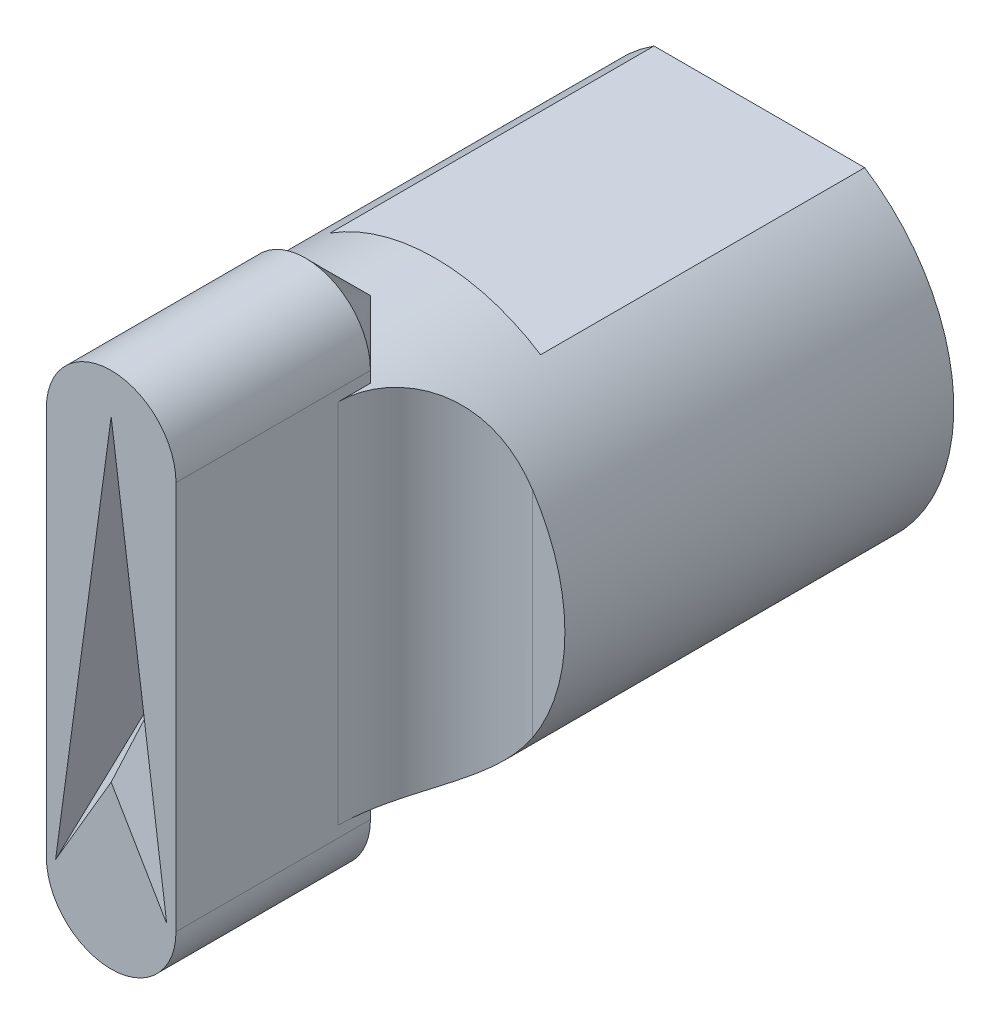
ISO-10303-21;
HEADER;
FILE_DESCRIPTION(('STEP AP214'),'2;1');
FILE_NAME('part.step','',(''),(''),'','','');
FILE_SCHEMA(('AUTOMOTIVE_DESIGN { 1 0 10303 214 1 1 1 1 }'));
ENDSEC;
DATA;
#1=APPLICATION_CONTEXT('core data for automotive mechanical design processes');
#2=APPLICATION_PROTOCOL_DEFINITION('international standard','automotive_design',2000,#1);
#3=PRODUCT_CONTEXT('',#1,'mechanical');
#4=PRODUCT('Part','Part','',(#3));
#5=PRODUCT_RELATED_PRODUCT_CATEGORY('part','',(#4));
#6=PRODUCT_DEFINITION_FORMATION('','',#4);
#7=PRODUCT_DEFINITION_CONTEXT('part definition',#1,'design');
#8=PRODUCT_DEFINITION('design','',#6,#7);
#9=PRODUCT_DEFINITION_SHAPE('','',#8);
#10=(LENGTH_UNIT() NAMED_UNIT(*) SI_UNIT(.MILLI.,.METRE.));
#11=(NAMED_UNIT(*) PLANE_ANGLE_UNIT() SI_UNIT($,.RADIAN.));
#12=(NAMED_UNIT(*) SI_UNIT($,.STERADIAN.) SOLID_ANGLE_UNIT());
#13=UNCERTAINTY_MEASURE_WITH_UNIT(LENGTH_MEASURE(1.E-05),#10,'distance_accuracy_value','');
#14=(GEOMETRIC_REPRESENTATION_CONTEXT(3) GLOBAL_UNCERTAINTY_ASSIGNED_CONTEXT((#13)) GLOBAL_UNIT_ASSIGNED_CONTEXT((#10,
#11,#12)) REPRESENTATION_CONTEXT('',''));
#15=CARTESIAN_POINT('',(0.,0.,0.));
#16=DIRECTION('',(0.,0.,1.));
#17=DIRECTION('',(1.,0.,0.));
#18=AXIS2_PLACEMENT_3D('',#15,#16,#17);
#19=CARTESIAN_POINT('',(0.,0.,12.));
#20=DIRECTION('',(0.,0.,1.));
#21=DIRECTION('',(1.,0.,0.));
#22=AXIS2_PLACEMENT_3D('',#19,#20,#21);
#23=PLANE('',#22);
#24=CARTESIAN_POINT('',(0.,0.,12.));
#25=DIRECTION('',(0.,0.,1.));
#26=DIRECTION('',(1.,0.,0.));
#27=AXIS2_PLACEMENT_3D('',#24,#25,#26);
#28=CIRCLE('',#27,6.);
#29=CARTESIAN_POINT('',(5.,-3.3166247903554,12.));
#30=VERTEX_POINT('',#29);
#31=CARTESIAN_POINT('',(5.,3.3166247903554,12.));
#32=VERTEX_POINT('',#31);
#33=EDGE_CURVE('E215',#30,#32,#28,.T.);
#34=ORIENTED_EDGE('',*,*,#33,.T.);
#35=DIRECTION('',(0.,1.,0.));
#36=VECTOR('',#35,1.);
#37=CARTESIAN_POINT('',(5.,0.,12.));
#38=LINE('',#37,#36);
#39=EDGE_CURVE('E257',#32,#30,#38,.F.);
#40=ORIENTED_EDGE('',*,*,#39,.T.);
#41=EDGE_LOOP('',(#34,#40));
#42=FACE_BOUND('',#41,.T.);
#43=ADVANCED_FACE('F35',(#42),#23,.T.);
#44=CARTESIAN_POINT('',(0.,0.,0.));
#45=DIRECTION('',(0.,0.,1.));
#46=DIRECTION('',(1.,0.,0.));
#47=AXIS2_PLACEMENT_3D('',#44,#45,#46);
#48=PLANE('',#47);
#49=CARTESIAN_POINT('',(0.,0.,0.));
#50=DIRECTION('',(0.,0.,1.));
#51=DIRECTION('',(1.,0.,0.));
#52=AXIS2_PLACEMENT_3D('',#49,#50,#51);
#53=CIRCLE('',#52,6.);
#54=CARTESIAN_POINT('',(-3.25,5.043560250458,0.));
#55=VERTEX_POINT('',#54);
#56=CARTESIAN_POINT('',(3.25,5.043560250458,0.));
#57=VERTEX_POINT('',#56);
#58=EDGE_CURVE('E235',#55,#57,#53,.T.);
#59=ORIENTED_EDGE('',*,*,#58,.F.);
#60=DIRECTION('',(-1.,0.,0.));
#61=VECTOR('',#60,1.);
#62=CARTESIAN_POINT('',(-3.25,5.043560250458,0.));
#63=LINE('',#62,#61);
#64=EDGE_CURVE('E240',#57,#55,#63,.T.);
#65=ORIENTED_EDGE('',*,*,#64,.F.);
#66=EDGE_LOOP('',(#59,#65));
#67=FACE_BOUND('',#66,.T.);
#68=CARTESIAN_POINT('',(0.,0.,0.));
#69=DIRECTION('',(0.,0.,1.));
#70=DIRECTION('',(1.,0.,0.));
#71=AXIS2_PLACEMENT_3D('',#68,#69,#70);
#72=CIRCLE('',#71,4.);
#73=CARTESIAN_POINT('',(-2.5,3.1224989991992,0.));
#74=VERTEX_POINT('',#73);
#75=CARTESIAN_POINT('',(2.5,3.1224989991992,0.));
#76=VERTEX_POINT('',#75);
#77=EDGE_CURVE('E214',#74,#76,#72,.T.);
#78=ORIENTED_EDGE('',*,*,#77,.T.);
#79=DIRECTION('',(-1.,0.,0.));
#80=VECTOR('',#79,1.);
#81=CARTESIAN_POINT('',(-2.5,3.1224989991992,0.));
#82=LINE('',#81,#80);
#83=EDGE_CURVE('E222',#76,#74,#82,.T.);
#84=ORIENTED_EDGE('',*,*,#83,.T.);
#85=EDGE_LOOP('',(#78,#84));
#86=FACE_BOUND('',#85,.T.);
#87=ADVANCED_FACE('F361',(#67,#86),#48,.F.);
#88=CARTESIAN_POINT('',(0.,0.,10.));
#89=DIRECTION('',(0.,0.,-1.));
#90=DIRECTION('',(-1.,0.,0.));
#91=AXIS2_PLACEMENT_3D('',#88,#89,#90);
#92=CYLINDRICAL_SURFACE('',#91,6.);
#93=ORIENTED_EDGE('',*,*,#58,.T.);
#94=DIRECTION('',(0.,0.,-1.));
#95=VECTOR('',#94,1.);
#96=CARTESIAN_POINT('',(3.25,5.043560250458,10.));
#97=LINE('',#96,#95);
#98=CARTESIAN_POINT('',(3.25,5.043560250458,10.));
#99=VERTEX_POINT('',#98);
#100=EDGE_CURVE('E246',#99,#57,#97,.T.);
#101=ORIENTED_EDGE('',*,*,#100,.F.);
#102=CARTESIAN_POINT('',(0.,0.,10.));
#103=DIRECTION('',(0.,0.,1.));
#104=DIRECTION('',(1.,0.,0.));
#105=AXIS2_PLACEMENT_3D('',#102,#103,#104);
#106=CIRCLE('',#105,6.);
#107=CARTESIAN_POINT('',(-3.25,5.043560250458,10.));
#108=VERTEX_POINT('',#107);
#109=EDGE_CURVE('E210',#99,#108,#106,.T.);
#110=ORIENTED_EDGE('',*,*,#109,.T.);
#111=DIRECTION('',(0.,0.,-1.));
#112=VECTOR('',#111,1.);
#113=CARTESIAN_POINT('',(-3.25,5.043560250458,10.));
#114=LINE('',#113,#112);
#115=EDGE_CURVE('E239',#108,#55,#114,.T.);
#116=ORIENTED_EDGE('',*,*,#115,.T.);
#117=EDGE_LOOP('',(#93,#101,#110,#116));
#118=FACE_BOUND('',#117,.T.);
#119=DIRECTION('',(0.,0.,-1.));
#120=VECTOR('',#119,1.);
#121=CARTESIAN_POINT('',(-2.,5.65685424949238,12.));
#122=LINE('',#121,#120);
#123=CARTESIAN_POINT('',(-2.,5.65685424949238,14.));
#124=VERTEX_POINT('',#123);
#125=CARTESIAN_POINT('',(-2.,5.65685424949238,15.));
#126=VERTEX_POINT('',#125);
#127=EDGE_CURVE('E259',#124,#126,#122,.F.);
#128=ORIENTED_EDGE('',*,*,#127,.F.);
#129=CARTESIAN_POINT('',(0.,0.,12.));
#130=DIRECTION('',(-0.707106781186547,0.,-0.707106781186548));
#131=DIRECTION('',(0.707106781186548,0.,-0.707106781186547));
#132=AXIS2_PLACEMENT_3D('',#129,#130,#131);
#133=ELLIPSE('',#132,8.48528137423856,6.);
#134=CARTESIAN_POINT('',(0.,6.,12.));
#135=VERTEX_POINT('',#134);
#136=EDGE_CURVE('E11',#124,#135,#133,.T.);
#137=ORIENTED_EDGE('',*,*,#136,.T.);
#138=CARTESIAN_POINT('',(0.,0.,12.));
#139=DIRECTION('',(0.707106781186547,0.,-0.707106781186548));
#140=DIRECTION('',(-0.707106781186548,0.,-0.707106781186547));
#141=AXIS2_PLACEMENT_3D('',#138,#139,#140);
#142=ELLIPSE('',#141,8.48528137423856,6.);
#143=CARTESIAN_POINT('',(2.,5.65685424949238,14.));
#144=VERTEX_POINT('',#143);
#145=EDGE_CURVE('E45',#135,#144,#142,.T.);
#146=ORIENTED_EDGE('',*,*,#145,.T.);
#147=DIRECTION('',(0.,0.,-1.));
#148=VECTOR('',#147,1.);
#149=CARTESIAN_POINT('',(2.,5.65685424949238,15.));
#150=LINE('',#149,#148);
#151=CARTESIAN_POINT('',(2.,5.65685424949238,15.));
#152=VERTEX_POINT('',#151);
#153=EDGE_CURVE('E254',#152,#144,#150,.T.);
#154=ORIENTED_EDGE('',*,*,#153,.F.);
#155=CARTESIAN_POINT('',(2.,5.65685424949238,15.));
#156=CARTESIAN_POINT('',(1.99999030322523,5.65684544711199,14.9209331553733));
#157=CARTESIAN_POINT('',(2.00312570643421,5.65574881890879,14.8418691489219));
#158=CARTESIAN_POINT('',(2.0156134549585,5.65131691738464,14.6842967234225));
#159=CARTESIAN_POINT('',(2.02496580467434,5.64798164247911,14.6057883047678));
#160=CARTESIAN_POINT('',(2.0498113799326,5.63901046789865,14.4498946996146));
#161=CARTESIAN_POINT('',(2.06530321698258,5.63337508840152,14.3725092632442));
#162=CARTESIAN_POINT('',(2.1022584901363,5.61968802433638,14.2194198723353));
#163=CARTESIAN_POINT('',(2.12372178247424,5.61163639794038,14.1437158773626));
#164=CARTESIAN_POINT('',(2.19682815316927,5.58361156789462,13.9198073219456));
#165=CARTESIAN_POINT('',(2.25718874952467,5.55976807735933,13.7747998497297));
#166=CARTESIAN_POINT('',(2.39844129323761,5.50030013952992,13.497983669548));
#167=CARTESIAN_POINT('',(2.47932101228338,5.46468270506657,13.3661671654775));
#168=CARTESIAN_POINT('',(2.65707954299298,5.38047246320795,13.1202303577708));
#169=CARTESIAN_POINT('',(2.75381788776566,5.3319914495914,13.0059703792125));
#170=CARTESIAN_POINT('',(2.95898470361778,5.22091746444496,12.7964185882072));
#171=CARTESIAN_POINT('',(3.06741377315073,5.15832377030141,12.7011277475103));
#172=CARTESIAN_POINT('',(3.29182311027431,5.01812492036047,12.5297164957066));
#173=CARTESIAN_POINT('',(3.40787243339238,4.94036454883279,12.4538148507028));
#174=CARTESIAN_POINT('',(3.64122012085815,4.77098418158319,12.3219966683647));
#175=CARTESIAN_POINT('',(3.75851912619936,4.67935672003309,12.266090951394));
#176=CARTESIAN_POINT('',(3.95316816333207,4.51477863881965,12.1872734318025));
#177=CARTESIAN_POINT('',(4.03140702456406,4.44510096186818,12.1595196008456));
#178=CARTESIAN_POINT('',(4.18534801919325,4.30046571733359,12.1116028978448));
#179=CARTESIAN_POINT('',(4.26104911656042,4.22550603121736,12.0914430924578));
#180=CARTESIAN_POINT('',(4.40907596329278,4.07081430521562,12.0577934779944));
#181=CARTESIAN_POINT('',(4.48139878740629,3.99107826098373,12.044309355873));
#182=CARTESIAN_POINT('',(4.62199060250191,3.82738076977179,12.0230614280348));
#183=CARTESIAN_POINT('',(4.69025922412637,3.74341893908541,12.0152981427815));
#184=CARTESIAN_POINT('',(4.79889827378919,3.60214809656078,12.0064421606067));
#185=CARTESIAN_POINT('',(4.8405885791415,3.54592724409215,12.0039608857093));
#186=CARTESIAN_POINT('',(4.92185327112251,3.43223362870751,12.0007437781573));
#187=CARTESIAN_POINT('',(4.96143475895086,3.37476612338706,12.0000016710378));
#188=CARTESIAN_POINT('',(5.,3.3166247903554,12.));
#189=B_SPLINE_CURVE_WITH_KNOTS('',3,(#155,#156,#157,#158,#159,#160,#161,#162,#163,#164,#165,
#166,#167,#168,#169,#170,#171,#172,#173,#174,#175,#176,#177,#178,#179,#180,#181,#182,#183,#184,
#185,#186,#187,#188),.UNSPECIFIED.,.F.,.F.,(4,2,2,2,2,2,2,2,2,2,2,2,2,2,2,2,4),(0.,
0.237125499452255,0.47425116674842,0.711323236819829,0.948389599754788,1.4225032726847,
1.89633505994488,2.36617662541235,2.83604225371267,3.31099594686116,3.78620626346684,
4.11094445022896,4.43581363413729,4.76095909701787,5.08613413693724,5.29618237512081,
5.50547163946397),.UNSPECIFIED.);
#190=EDGE_CURVE('E269',#152,#32,#189,.T.);
#191=ORIENTED_EDGE('',*,*,#190,.T.);
#192=ORIENTED_EDGE('',*,*,#33,.F.);
#193=CARTESIAN_POINT('',(5.,-3.3166247903554,12.));
#194=CARTESIAN_POINT('',(4.92997768495384,-3.42223455085103,12.000013192834));
#195=CARTESIAN_POINT('',(4.85652421094499,-3.52566227424765,12.0024539924428));
#196=CARTESIAN_POINT('',(4.70322285983861,-3.72769802477806,12.0137196797467));
#197=CARTESIAN_POINT('',(4.62335927078561,-3.82629319224918,12.0225607080935));
#198=CARTESIAN_POINT('',(4.45744311900763,-4.01838838866867,12.0482676784447));
#199=CARTESIAN_POINT('',(4.37134840672353,-4.11184436187014,12.0651936653655));
#200=CARTESIAN_POINT('',(4.19468566350177,-4.29190839424692,12.1086805431705));
#201=CARTESIAN_POINT('',(4.10412297941146,-4.37852433075617,12.1352301479613));
#202=CARTESIAN_POINT('',(3.94888809338516,-4.51813255151834,12.1893696478606));
#203=CARTESIAN_POINT('',(3.88500242352988,-4.57315137163529,12.214022629395));
#204=CARTESIAN_POINT('',(3.75645595832008,-4.67931391080725,12.2689780559339));
#205=CARTESIAN_POINT('',(3.69179537848076,-4.73045867960339,12.2992789627782));
#206=CARTESIAN_POINT('',(3.56263954519,-4.82847295532662,12.3657540761552));
#207=CARTESIAN_POINT('',(3.49814445999783,-4.87535615810999,12.4019083478705));
#208=CARTESIAN_POINT('',(3.36995652879297,-4.96482619843247,12.4803569397262));
#209=CARTESIAN_POINT('',(3.30626332485113,-5.00741501696076,12.5226484066285));
#210=CARTESIAN_POINT('',(3.18005663770517,-5.0885076097312,12.6138083453507));
#211=CARTESIAN_POINT('',(3.11755598289258,-5.12697747390182,12.6627248653073));
#212=CARTESIAN_POINT('',(2.99521652107006,-5.19939712303774,12.7667759939909));
#213=CARTESIAN_POINT('',(2.9353765821409,-5.23334884259896,12.8219079225809));
#214=CARTESIAN_POINT('',(2.81920448597277,-5.29683618606131,12.938231455915));
#215=CARTESIAN_POINT('',(2.76287585786139,-5.32636740750303,12.9994290020517));
#216=CARTESIAN_POINT('',(2.65469230037435,-5.38110452811131,13.1274174490228));
#217=CARTESIAN_POINT('',(2.60283700351034,-5.40631078274651,13.1942078895056));
#218=CARTESIAN_POINT('',(2.46447504364706,-5.47138648250789,13.3891740960493));
#219=CARTESIAN_POINT('',(2.38392140054286,-5.50659615462353,13.5232523175651));
#220=CARTESIAN_POINT('',(2.24403997745841,-5.56507822095636,13.8044451091643));
#221=CARTESIAN_POINT('',(2.18471139724693,-5.58835106523238,13.9515591875063));
#222=CARTESIAN_POINT('',(2.11467265350155,-5.61504395928871,14.1749962582673));
#223=CARTESIAN_POINT('',(2.09476476098327,-5.62248068284136,14.2480930356354));
#224=CARTESIAN_POINT('',(2.06050021457182,-5.6351288761913,14.3957828938795));
#225=CARTESIAN_POINT('',(2.04614340641176,-5.64034040782801,14.4703759331132));
#226=CARTESIAN_POINT('',(2.02312322591586,-5.64863957607688,14.62055766576));
#227=CARTESIAN_POINT('',(2.01446066675661,-5.65172690934236,14.6961464998077));
#228=CARTESIAN_POINT('',(2.0028947765376,-5.65583053014101,14.8478226797089));
#229=CARTESIAN_POINT('',(1.99999169674582,-5.65684672731708,14.9239100471664));
#230=CARTESIAN_POINT('',(2.,-5.65685424949238,15.));
#231=B_SPLINE_CURVE_WITH_KNOTS('',3,(#193,#194,#195,#196,#197,#198,#199,#200,#201,#202,#203,
#204,#205,#206,#207,#208,#209,#210,#211,#212,#213,#214,#215,#216,#217,#218,#219,#220,#221,#222,
#223,#224,#225,#226,#227,#228,#229,#230),.UNSPECIFIED.,.F.,.F.,(4,2,2,2,2,2,2,2,2,2,2,2,2,2,2,2,
2,2,4),(0.,0.380175594659023,0.761313303994744,1.14532670876387,1.52889121137833,
1.7921772853231,2.0553917602348,2.31772796648959,2.57994259866947,2.84417241909742,
3.10828873406494,3.37266636209774,3.6370222505377,4.11549765714783,4.59395502228815,
4.8221216939859,5.05028202438353,5.27847493051768,5.50667779177234),.UNSPECIFIED.);
#232=CARTESIAN_POINT('',(2.,-5.65685424949238,15.));
#233=VERTEX_POINT('',#232);
#234=EDGE_CURVE('E277',#30,#233,#231,.T.);
#235=ORIENTED_EDGE('',*,*,#234,.T.);
#236=DIRECTION('',(0.,0.,-1.));
#237=VECTOR('',#236,1.);
#238=CARTESIAN_POINT('',(2.,-5.65685424949238,12.));
#239=LINE('',#238,#237);
#240=CARTESIAN_POINT('',(2.,-5.65685424949238,14.));
#241=VERTEX_POINT('',#240);
#242=EDGE_CURVE('E249',#241,#233,#239,.F.);
#243=ORIENTED_EDGE('',*,*,#242,.F.);
#244=CARTESIAN_POINT('',(0.,0.,12.));
#245=DIRECTION('',(0.707106781186547,0.,-0.707106781186548));
#246=DIRECTION('',(-0.707106781186548,0.,-0.707106781186547));
#247=AXIS2_PLACEMENT_3D('',#244,#245,#246);
#248=ELLIPSE('',#247,8.48528137423856,6.);
#249=CARTESIAN_POINT('',(0.,-6.,12.));
#250=VERTEX_POINT('',#249);
#251=EDGE_CURVE('E331',#241,#250,#248,.T.);
#252=ORIENTED_EDGE('',*,*,#251,.T.);
#253=CARTESIAN_POINT('',(0.,0.,12.));
#254=DIRECTION('',(-0.707106781186547,0.,-0.707106781186548));
#255=DIRECTION('',(0.707106781186548,0.,-0.707106781186547));
#256=AXIS2_PLACEMENT_3D('',#253,#254,#255);
#257=ELLIPSE('',#256,8.48528137423856,6.);
#258=CARTESIAN_POINT('',(-2.,-5.65685424949238,14.));
#259=VERTEX_POINT('',#258);
#260=EDGE_CURVE('E329',#250,#259,#257,.T.);
#261=ORIENTED_EDGE('',*,*,#260,.T.);
#262=DIRECTION('',(0.,0.,-1.));
#263=VECTOR('',#262,1.);
#264=CARTESIAN_POINT('',(-2.,-5.65685424949238,15.));
#265=LINE('',#264,#263);
#266=CARTESIAN_POINT('',(-2.,-5.65685424949238,15.));
#267=VERTEX_POINT('',#266);
#268=EDGE_CURVE('E264',#267,#259,#265,.T.);
#269=ORIENTED_EDGE('',*,*,#268,.F.);
#270=CARTESIAN_POINT('',(-2.,-5.65685424949238,15.));
#271=CARTESIAN_POINT('',(-1.99999030322523,-5.65684544711199,14.9209331553733));
#272=CARTESIAN_POINT('',(-2.00312570643421,-5.65574881890879,14.8418691489219));
#273=CARTESIAN_POINT('',(-2.0156134549585,-5.65131691738464,14.6842967234225));
#274=CARTESIAN_POINT('',(-2.02496580467434,-5.64798164247911,14.6057883047678));
#275=CARTESIAN_POINT('',(-2.0498113799326,-5.63901046789865,14.4498946996146));
#276=CARTESIAN_POINT('',(-2.06530321698258,-5.63337508840152,14.3725092632442));
#277=CARTESIAN_POINT('',(-2.1022584901363,-5.61968802433638,14.2194198723353));
#278=CARTESIAN_POINT('',(-2.12372178247424,-5.61163639794038,14.1437158773626));
#279=CARTESIAN_POINT('',(-2.19682815316927,-5.58361156789462,13.9198073219456));
#280=CARTESIAN_POINT('',(-2.25718874952467,-5.55976807735933,13.7747998497297));
#281=CARTESIAN_POINT('',(-2.39844129323761,-5.50030013952992,13.497983669548));
#282=CARTESIAN_POINT('',(-2.47932101228338,-5.46468270506657,13.3661671654775));
#283=CARTESIAN_POINT('',(-2.65707954299298,-5.38047246320795,13.1202303577708));
#284=CARTESIAN_POINT('',(-2.75381788776566,-5.3319914495914,13.0059703792125));
#285=CARTESIAN_POINT('',(-2.95898470361778,-5.22091746444496,12.7964185882072));
#286=CARTESIAN_POINT('',(-3.06741377315073,-5.15832377030141,12.7011277475103));
#287=CARTESIAN_POINT('',(-3.29182311027431,-5.01812492036047,12.5297164957066));
#288=CARTESIAN_POINT('',(-3.40787243339238,-4.94036454883279,12.4538148507028));
#289=CARTESIAN_POINT('',(-3.64122012085815,-4.77098418158319,12.3219966683647));
#290=CARTESIAN_POINT('',(-3.75851912619936,-4.67935672003309,12.266090951394));
#291=CARTESIAN_POINT('',(-3.95316816333207,-4.51477863881965,12.1872734318025));
#292=CARTESIAN_POINT('',(-4.03140702456406,-4.44510096186818,12.1595196008456));
#293=CARTESIAN_POINT('',(-4.18534801919325,-4.30046571733359,12.1116028978448));
#294=CARTESIAN_POINT('',(-4.26104911656042,-4.22550603121736,12.0914430924578));
#295=CARTESIAN_POINT('',(-4.40907596329278,-4.07081430521562,12.0577934779944));
#296=CARTESIAN_POINT('',(-4.48139878740629,-3.99107826098373,12.044309355873));
#297=CARTESIAN_POINT('',(-4.62199060250191,-3.82738076977179,12.0230614280348));
#298=CARTESIAN_POINT('',(-4.69025922412637,-3.74341893908541,12.0152981427815));
#299=CARTESIAN_POINT('',(-4.79889827378919,-3.60214809656078,12.0064421606067));
#300=CARTESIAN_POINT('',(-4.8405885791415,-3.54592724409215,12.0039608857093));
#301=CARTESIAN_POINT('',(-4.92185327112251,-3.43223362870751,12.0007437781573));
#302=CARTESIAN_POINT('',(-4.96143475895086,-3.37476612338706,12.0000016710378));
#303=CARTESIAN_POINT('',(-5.,-3.3166247903554,12.));
#304=B_SPLINE_CURVE_WITH_KNOTS('',3,(#270,#271,#272,#273,#274,#275,#276,#277,#278,#279,#280,
#281,#282,#283,#284,#285,#286,#287,#288,#289,#290,#291,#292,#293,#294,#295,#296,#297,#298,#299,
#300,#301,#302,#303),.UNSPECIFIED.,.F.,.F.,(4,2,2,2,2,2,2,2,2,2,2,2,2,2,2,2,4),(0.,
0.237125499452255,0.47425116674842,0.711323236819829,0.948389599754788,1.4225032726847,
1.89633505994488,2.36617662541235,2.83604225371267,3.31099594686116,3.78620626346684,
4.11094445022896,4.43581363413729,4.76095909701787,5.08613413693724,5.29618237512081,
5.50547163946397),.UNSPECIFIED.);
#305=CARTESIAN_POINT('',(-5.,-3.3166247903554,12.));
#306=VERTEX_POINT('',#305);
#307=EDGE_CURVE('E302',#267,#306,#304,.T.);
#308=ORIENTED_EDGE('',*,*,#307,.T.);
#309=CARTESIAN_POINT('',(-5.,3.3166247903554,12.));
#310=VERTEX_POINT('',#309);
#311=EDGE_CURVE('E211',#310,#306,#28,.T.);
#312=ORIENTED_EDGE('',*,*,#311,.F.);
#313=CARTESIAN_POINT('',(-5.,3.3166247903554,12.));
#314=CARTESIAN_POINT('',(-4.92997768495384,3.42223455085103,12.000013192834));
#315=CARTESIAN_POINT('',(-4.85652421094499,3.52566227424765,12.0024539924428));
#316=CARTESIAN_POINT('',(-4.70322285983861,3.72769802477806,12.0137196797467));
#317=CARTESIAN_POINT('',(-4.62335927078561,3.82629319224918,12.0225607080935));
#318=CARTESIAN_POINT('',(-4.45744311900763,4.01838838866867,12.0482676784447));
#319=CARTESIAN_POINT('',(-4.37134840672353,4.11184436187014,12.0651936653655));
#320=CARTESIAN_POINT('',(-4.19468566350177,4.29190839424692,12.1086805431705));
#321=CARTESIAN_POINT('',(-4.10412297941146,4.37852433075617,12.1352301479613));
#322=CARTESIAN_POINT('',(-3.94888809338516,4.51813255151834,12.1893696478606));
#323=CARTESIAN_POINT('',(-3.88500242352988,4.57315137163529,12.214022629395));
#324=CARTESIAN_POINT('',(-3.75645595832008,4.67931391080725,12.2689780559339));
#325=CARTESIAN_POINT('',(-3.69179537848076,4.73045867960339,12.2992789627782));
#326=CARTESIAN_POINT('',(-3.56263954519,4.82847295532662,12.3657540761552));
#327=CARTESIAN_POINT('',(-3.49814445999783,4.87535615810999,12.4019083478705));
#328=CARTESIAN_POINT('',(-3.36995652879297,4.96482619843247,12.4803569397262));
#329=CARTESIAN_POINT('',(-3.30626332485113,5.00741501696076,12.5226484066285));
#330=CARTESIAN_POINT('',(-3.18005663770517,5.0885076097312,12.6138083453507));
#331=CARTESIAN_POINT('',(-3.11755598289258,5.12697747390182,12.6627248653073));
#332=CARTESIAN_POINT('',(-2.99521652107006,5.19939712303774,12.7667759939909));
#333=CARTESIAN_POINT('',(-2.9353765821409,5.23334884259896,12.8219079225809));
#334=CARTESIAN_POINT('',(-2.81920448597277,5.29683618606131,12.938231455915));
#335=CARTESIAN_POINT('',(-2.76287585786139,5.32636740750303,12.9994290020517));
#336=CARTESIAN_POINT('',(-2.65469230037435,5.38110452811131,13.1274174490228));
#337=CARTESIAN_POINT('',(-2.60283700351034,5.40631078274651,13.1942078895056));
#338=CARTESIAN_POINT('',(-2.46447504364706,5.47138648250789,13.3891740960493));
#339=CARTESIAN_POINT('',(-2.38392140054286,5.50659615462353,13.5232523175651));
#340=CARTESIAN_POINT('',(-2.24403997745841,5.56507822095636,13.8044451091643));
#341=CARTESIAN_POINT('',(-2.18471139724693,5.58835106523238,13.9515591875063));
#342=CARTESIAN_POINT('',(-2.11467265350155,5.61504395928871,14.1749962582673));
#343=CARTESIAN_POINT('',(-2.09476476098327,5.62248068284136,14.2480930356354));
#344=CARTESIAN_POINT('',(-2.06050021457182,5.6351288761913,14.3957828938795));
#345=CARTESIAN_POINT('',(-2.04614340641176,5.64034040782801,14.4703759331132));
#346=CARTESIAN_POINT('',(-2.02312322591586,5.64863957607688,14.62055766576));
#347=CARTESIAN_POINT('',(-2.01446066675661,5.65172690934236,14.6961464998077));
#348=CARTESIAN_POINT('',(-2.0028947765376,5.65583053014101,14.8478226797089));
#349=CARTESIAN_POINT('',(-1.99999169674582,5.65684672731708,14.9239100471664));
#350=CARTESIAN_POINT('',(-2.,5.65685424949238,15.));
#351=B_SPLINE_CURVE_WITH_KNOTS('',3,(#313,#314,#315,#316,#317,#318,#319,#320,#321,#322,#323,
#324,#325,#326,#327,#328,#329,#330,#331,#332,#333,#334,#335,#336,#337,#338,#339,#340,#341,#342,
#343,#344,#345,#346,#347,#348,#349,#350),.UNSPECIFIED.,.F.,.F.,(4,2,2,2,2,2,2,2,2,2,2,2,2,2,2,2,
2,2,4),(0.,0.380175594659023,0.761313303994744,1.14532670876387,1.52889121137833,
1.7921772853231,2.0553917602348,2.31772796648959,2.57994259866947,2.84417241909742,
3.10828873406494,3.37266636209774,3.6370222505377,4.11549765714783,4.59395502228815,
4.8221216939859,5.05028202438353,5.27847493051768,5.50667779177234),.UNSPECIFIED.);
#352=EDGE_CURVE('E308',#310,#126,#351,.T.);
#353=ORIENTED_EDGE('',*,*,#352,.T.);
#354=EDGE_LOOP('',(#128,#137,#146,#154,#191,#192,#235,#243,#252,#261,#269,#308,#312,#353));
#355=FACE_BOUND('',#354,.T.);
#356=ADVANCED_FACE('F283',(#118,#355),#92,.T.);
#357=CARTESIAN_POINT('',(-3.25,5.043560250458,10.));
#358=DIRECTION('',(0.,-1.,0.));
#359=DIRECTION('',(0.,0.,-1.));
#360=AXIS2_PLACEMENT_3D('',#357,#358,#359);
#361=PLANE('',#360);
#362=ORIENTED_EDGE('',*,*,#64,.T.);
#363=ORIENTED_EDGE('',*,*,#115,.F.);
#364=DIRECTION('',(-1.,0.,0.));
#365=VECTOR('',#364,1.);
#366=CARTESIAN_POINT('',(-3.25,5.043560250458,10.));
#367=LINE('',#366,#365);
#368=EDGE_CURVE('E236',#99,#108,#367,.T.);
#369=ORIENTED_EDGE('',*,*,#368,.F.);
#370=ORIENTED_EDGE('',*,*,#100,.T.);
#371=EDGE_LOOP('',(#362,#363,#369,#370));
#372=FACE_BOUND('',#371,.T.);
#373=ADVANCED_FACE('F489',(#372),#361,.F.);
#374=CARTESIAN_POINT('',(0.,0.,10.));
#375=DIRECTION('',(0.,0.,-1.));
#376=DIRECTION('',(-1.,0.,0.));
#377=AXIS2_PLACEMENT_3D('',#374,#375,#376);
#378=CYLINDRICAL_SURFACE('',#377,4.);
#379=ORIENTED_EDGE('',*,*,#77,.F.);
#380=DIRECTION('',(0.,0.,-1.));
#381=VECTOR('',#380,1.);
#382=CARTESIAN_POINT('',(-2.5,3.1224989991992,10.));
#383=LINE('',#382,#381);
#384=CARTESIAN_POINT('',(-2.5,3.1224989991992,10.));
#385=VERTEX_POINT('',#384);
#386=EDGE_CURVE('E225',#385,#74,#383,.T.);
#387=ORIENTED_EDGE('',*,*,#386,.F.);
#388=CARTESIAN_POINT('',(0.,0.,10.));
#389=DIRECTION('',(0.,0.,1.));
#390=DIRECTION('',(1.,0.,0.));
#391=AXIS2_PLACEMENT_3D('',#388,#389,#390);
#392=CIRCLE('',#391,4.);
#393=CARTESIAN_POINT('',(2.5,3.1224989991992,10.));
#394=VERTEX_POINT('',#393);
#395=EDGE_CURVE('E218',#385,#394,#392,.T.);
#396=ORIENTED_EDGE('',*,*,#395,.T.);
#397=DIRECTION('',(0.,0.,-1.));
#398=VECTOR('',#397,1.);
#399=CARTESIAN_POINT('',(2.5,3.1224989991992,10.));
#400=LINE('',#399,#398);
#401=EDGE_CURVE('E232',#394,#76,#400,.T.);
#402=ORIENTED_EDGE('',*,*,#401,.T.);
#403=EDGE_LOOP('',(#379,#387,#396,#402));
#404=FACE_BOUND('',#403,.T.);
#405=ADVANCED_FACE('F530',(#404),#378,.F.);
#406=CARTESIAN_POINT('',(-2.5,3.1224989991992,10.));
#407=DIRECTION('',(0.,-1.,0.));
#408=DIRECTION('',(0.,0.,-1.));
#409=AXIS2_PLACEMENT_3D('',#406,#407,#408);
#410=PLANE('',#409);
#411=ORIENTED_EDGE('',*,*,#83,.F.);
#412=ORIENTED_EDGE('',*,*,#401,.F.);
#413=DIRECTION('',(-1.,0.,0.));
#414=VECTOR('',#413,1.);
#415=CARTESIAN_POINT('',(-2.5,3.1224989991992,10.));
#416=LINE('',#415,#414);
#417=EDGE_CURVE('E221',#394,#385,#416,.T.);
#418=ORIENTED_EDGE('',*,*,#417,.T.);
#419=ORIENTED_EDGE('',*,*,#386,.T.);
#420=EDGE_LOOP('',(#411,#412,#418,#419));
#421=FACE_BOUND('',#420,.T.);
#422=ADVANCED_FACE('F381',(#421),#410,.T.);
#423=CARTESIAN_POINT('',(0.,0.,10.));
#424=DIRECTION('',(0.,0.,1.));
#425=DIRECTION('',(1.,0.,0.));
#426=AXIS2_PLACEMENT_3D('',#423,#424,#425);
#427=PLANE('',#426);
#428=ORIENTED_EDGE('',*,*,#417,.F.);
#429=ORIENTED_EDGE('',*,*,#395,.F.);
#430=EDGE_LOOP('',(#428,#429));
#431=FACE_BOUND('',#430,.T.);
#432=ADVANCED_FACE('F373',(#431),#427,.F.);
#433=ORIENTED_EDGE('',*,*,#311,.T.);
#434=DIRECTION('',(0.,-1.,0.));
#435=VECTOR('',#434,1.);
#436=CARTESIAN_POINT('',(-5.,0.,12.));
#437=LINE('',#436,#435);
#438=EDGE_CURVE('E267',#306,#310,#437,.F.);
#439=ORIENTED_EDGE('',*,*,#438,.T.);
#440=EDGE_LOOP('',(#433,#439));
#441=FACE_BOUND('',#440,.T.);
#442=ADVANCED_FACE('F363',(#441),#23,.T.);
#443=ORIENTED_EDGE('',*,*,#109,.F.);
#444=ORIENTED_EDGE('',*,*,#368,.T.);
#445=EDGE_LOOP('',(#443,#444));
#446=FACE_BOUND('',#445,.T.);
#447=ADVANCED_FACE('F372',(#446),#427,.F.);
#448=CARTESIAN_POINT('',(0.,6.,20.));
#449=DIRECTION('',(0.,0.,-1.));
#450=DIRECTION('',(-1.,0.,0.));
#451=AXIS2_PLACEMENT_3D('',#448,#449,#450);
#452=CYLINDRICAL_SURFACE('',#451,2.);
#453=DIRECTION('',(0.,0.,-1.));
#454=VECTOR('',#453,1.);
#455=CARTESIAN_POINT('',(2.,6.,20.));
#456=LINE('',#455,#454);
#457=CARTESIAN_POINT('',(2.,6.,20.));
#458=VERTEX_POINT('',#457);
#459=CARTESIAN_POINT('',(2.,6.,14.));
#460=VERTEX_POINT('',#459);
#461=EDGE_CURVE('E198',#458,#460,#456,.T.);
#462=ORIENTED_EDGE('',*,*,#461,.T.);
#463=CARTESIAN_POINT('',(0.,6.,14.));
#464=DIRECTION('',(0.,0.,-1.));
#465=DIRECTION('',(-1.,0.,0.));
#466=AXIS2_PLACEMENT_3D('',#463,#464,#465);
#467=CIRCLE('',#466,2.);
#468=CARTESIAN_POINT('',(-2.,6.,14.));
#469=VERTEX_POINT('',#468);
#470=EDGE_CURVE('E327',#460,#469,#467,.F.);
#471=ORIENTED_EDGE('',*,*,#470,.T.);
#472=DIRECTION('',(0.,0.,-1.));
#473=VECTOR('',#472,1.);
#474=CARTESIAN_POINT('',(-2.,6.,20.));
#475=LINE('',#474,#473);
#476=CARTESIAN_POINT('',(-2.,6.,20.));
#477=VERTEX_POINT('',#476);
#478=EDGE_CURVE('E207',#477,#469,#475,.T.);
#479=ORIENTED_EDGE('',*,*,#478,.F.);
#480=CARTESIAN_POINT('',(0.,6.,20.));
#481=DIRECTION('',(0.,0.,1.));
#482=DIRECTION('',(-1.,0.,0.));
#483=AXIS2_PLACEMENT_3D('',#480,#481,#482);
#484=CIRCLE('',#483,2.);
#485=EDGE_CURVE('E188',#458,#477,#484,.T.);
#486=ORIENTED_EDGE('',*,*,#485,.F.);
#487=EDGE_LOOP('',(#462,#471,#479,#486));
#488=FACE_BOUND('',#487,.T.);
#489=ADVANCED_FACE('F379',(#488),#452,.T.);
#490=CARTESIAN_POINT('',(-2.,6.,20.));
#491=DIRECTION('',(1.,0.,0.));
#492=DIRECTION('',(0.,0.,-1.));
#493=AXIS2_PLACEMENT_3D('',#490,#491,#492);
#494=PLANE('',#493);
#495=ORIENTED_EDGE('',*,*,#268,.T.);
#496=DIRECTION('',(0.,-1.,0.));
#497=VECTOR('',#496,1.);
#498=CARTESIAN_POINT('',(-2.,-6.,14.));
#499=LINE('',#498,#497);
#500=CARTESIAN_POINT('',(-2.,-6.,14.));
#501=VERTEX_POINT('',#500);
#502=EDGE_CURVE('E317',#259,#501,#499,.T.);
#503=ORIENTED_EDGE('',*,*,#502,.T.);
#504=DIRECTION('',(0.,0.,-1.));
#505=VECTOR('',#504,1.);
#506=CARTESIAN_POINT('',(-2.,-6.,20.));
#507=LINE('',#506,#505);
#508=CARTESIAN_POINT('',(-2.,-6.,20.));
#509=VERTEX_POINT('',#508);
#510=EDGE_CURVE('E204',#509,#501,#507,.T.);
#511=ORIENTED_EDGE('',*,*,#510,.F.);
#512=DIRECTION('',(0.,-1.,0.));
#513=VECTOR('',#512,1.);
#514=CARTESIAN_POINT('',(-2.,6.,20.));
#515=LINE('',#514,#513);
#516=EDGE_CURVE('E191',#477,#509,#515,.T.);
#517=ORIENTED_EDGE('',*,*,#516,.F.);
#518=ORIENTED_EDGE('',*,*,#478,.T.);
#519=DIRECTION('',(0.,-1.,0.));
#520=VECTOR('',#519,1.);
#521=CARTESIAN_POINT('',(-2.,5.65685424949238,14.));
#522=LINE('',#521,#520);
#523=EDGE_CURVE('E315',#469,#124,#522,.T.);
#524=ORIENTED_EDGE('',*,*,#523,.T.);
#525=ORIENTED_EDGE('',*,*,#127,.T.);
#526=DIRECTION('',(0.,-1.,0.));
#527=VECTOR('',#526,1.);
#528=CARTESIAN_POINT('',(-2.,6.,15.));
#529=LINE('',#528,#527);
#530=EDGE_CURVE('E261',#126,#267,#529,.T.);
#531=ORIENTED_EDGE('',*,*,#530,.T.);
#532=EDGE_LOOP('',(#495,#503,#511,#517,#518,#524,#525,#531));
#533=FACE_BOUND('',#532,.T.);
#534=ADVANCED_FACE('F389',(#533),#494,.F.);
#535=CARTESIAN_POINT('',(0.,-6.,20.));
#536=DIRECTION('',(0.,0.,-1.));
#537=DIRECTION('',(-1.,0.,0.));
#538=AXIS2_PLACEMENT_3D('',#535,#536,#537);
#539=CYLINDRICAL_SURFACE('',#538,2.);
#540=ORIENTED_EDGE('',*,*,#510,.T.);
#541=CARTESIAN_POINT('',(0.,-6.,14.));
#542=DIRECTION('',(0.,0.,-1.));
#543=DIRECTION('',(-1.,0.,0.));
#544=AXIS2_PLACEMENT_3D('',#541,#542,#543);
#545=CIRCLE('',#544,2.);
#546=CARTESIAN_POINT('',(2.,-6.,14.));
#547=VERTEX_POINT('',#546);
#548=EDGE_CURVE('E325',#501,#547,#545,.F.);
#549=ORIENTED_EDGE('',*,*,#548,.T.);
#550=DIRECTION('',(0.,0.,-1.));
#551=VECTOR('',#550,1.);
#552=CARTESIAN_POINT('',(2.,-6.,20.));
#553=LINE('',#552,#551);
#554=CARTESIAN_POINT('',(2.,-6.,20.));
#555=VERTEX_POINT('',#554);
#556=EDGE_CURVE('E201',#555,#547,#553,.T.);
#557=ORIENTED_EDGE('',*,*,#556,.F.);
#558=CARTESIAN_POINT('',(0.,-6.,20.));
#559=DIRECTION('',(0.,0.,1.));
#560=DIRECTION('',(1.,0.,0.));
#561=AXIS2_PLACEMENT_3D('',#558,#559,#560);
#562=CIRCLE('',#561,2.);
#563=EDGE_CURVE('E194',#509,#555,#562,.T.);
#564=ORIENTED_EDGE('',*,*,#563,.F.);
#565=EDGE_LOOP('',(#540,#549,#557,#564));
#566=FACE_BOUND('',#565,.T.);
#567=ADVANCED_FACE('F399',(#566),#539,.T.);
#568=CARTESIAN_POINT('',(2.,6.,20.));
#569=DIRECTION('',(-1.,0.,0.));
#570=DIRECTION('',(0.,0.,1.));
#571=AXIS2_PLACEMENT_3D('',#568,#569,#570);
#572=PLANE('',#571);
#573=ORIENTED_EDGE('',*,*,#556,.T.);
#574=DIRECTION('',(0.,1.,0.));
#575=VECTOR('',#574,1.);
#576=CARTESIAN_POINT('',(2.,-5.65685424949238,14.));
#577=LINE('',#576,#575);
#578=EDGE_CURVE('E323',#547,#241,#577,.T.);
#579=ORIENTED_EDGE('',*,*,#578,.T.);
#580=ORIENTED_EDGE('',*,*,#242,.T.);
#581=DIRECTION('',(0.,1.,0.));
#582=VECTOR('',#581,1.);
#583=CARTESIAN_POINT('',(2.,6.,15.));
#584=LINE('',#583,#582);
#585=EDGE_CURVE('E251',#233,#152,#584,.T.);
#586=ORIENTED_EDGE('',*,*,#585,.T.);
#587=ORIENTED_EDGE('',*,*,#153,.T.);
#588=DIRECTION('',(0.,1.,0.));
#589=VECTOR('',#588,1.);
#590=CARTESIAN_POINT('',(2.,6.,14.));
#591=LINE('',#590,#589);
#592=EDGE_CURVE('E320',#144,#460,#591,.T.);
#593=ORIENTED_EDGE('',*,*,#592,.T.);
#594=ORIENTED_EDGE('',*,*,#461,.F.);
#595=DIRECTION('',(0.,1.,0.));
#596=VECTOR('',#595,1.);
#597=CARTESIAN_POINT('',(2.,6.,20.));
#598=LINE('',#597,#596);
#599=EDGE_CURVE('E196',#555,#458,#598,.T.);
#600=ORIENTED_EDGE('',*,*,#599,.F.);
#601=EDGE_LOOP('',(#573,#579,#580,#586,#587,#593,#594,#600));
#602=FACE_BOUND('',#601,.T.);
#603=ADVANCED_FACE('F350',(#602),#572,.F.);
#604=CARTESIAN_POINT('',(0.,6.,20.));
#605=DIRECTION('',(0.,0.,-1.));
#606=DIRECTION('',(-1.,0.,0.));
#607=AXIS2_PLACEMENT_3D('',#604,#605,#606);
#608=PLANE('',#607);
#609=DIRECTION('',(-0.133810720577083,-0.991006907674534,0.));
#610=VECTOR('',#609,1.);
#611=CARTESIAN_POINT('',(0.,6.76562190037089,20.));
#612=LINE('',#611,#610);
#613=CARTESIAN_POINT('',(0.,6.76562190037089,20.));
#614=VERTEX_POINT('',#613);
#615=CARTESIAN_POINT('',(-1.71340670688913,-5.92392849484469,20.));
#616=VERTEX_POINT('',#615);
#617=EDGE_CURVE('E171',#614,#616,#612,.T.);
#618=ORIENTED_EDGE('',*,*,#617,.F.);
#619=DIRECTION('',(-0.133810720577083,0.991006907674534,0.));
#620=VECTOR('',#619,1.);
#621=CARTESIAN_POINT('',(0.,6.76562190037089,20.));
#622=LINE('',#621,#620);
#623=CARTESIAN_POINT('',(1.71340670688913,-5.92392849484469,20.));
#624=VERTEX_POINT('',#623);
#625=EDGE_CURVE('E53',#624,#614,#622,.T.);
#626=ORIENTED_EDGE('',*,*,#625,.F.);
#627=DIRECTION('',(0.505881253679292,-0.862603128429214,0.));
#628=VECTOR('',#627,1.);
#629=CARTESIAN_POINT('',(1.71340670688913,-5.92392849484469,20.));
#630=LINE('',#629,#628);
#631=CARTESIAN_POINT('',(0.,-3.00231403515738,20.));
#632=VERTEX_POINT('',#631);
#633=EDGE_CURVE('E178',#632,#624,#630,.T.);
#634=ORIENTED_EDGE('',*,*,#633,.F.);
#635=DIRECTION('',(0.505881253679292,0.862603128429214,0.));
#636=VECTOR('',#635,1.);
#637=CARTESIAN_POINT('',(-1.71340670688913,-5.92392849484469,20.));
#638=LINE('',#637,#636);
#639=EDGE_CURVE('E164',#616,#632,#638,.T.);
#640=ORIENTED_EDGE('',*,*,#639,.F.);
#641=EDGE_LOOP('',(#618,#626,#634,#640));
#642=FACE_BOUND('',#641,.T.);
#643=ORIENTED_EDGE('',*,*,#485,.T.);
#644=ORIENTED_EDGE('',*,*,#516,.T.);
#645=ORIENTED_EDGE('',*,*,#563,.T.);
#646=ORIENTED_EDGE('',*,*,#599,.T.);
#647=EDGE_LOOP('',(#643,#644,#645,#646));
#648=FACE_BOUND('',#647,.T.);
#649=ADVANCED_FACE('F175',(#642,#648),#608,.F.);
#650=CARTESIAN_POINT('',(5.,6.,15.));
#651=DIRECTION('',(0.,1.,0.));
#652=DIRECTION('',(0.,0.,1.));
#653=AXIS2_PLACEMENT_3D('',#650,#651,#652);
#654=CYLINDRICAL_SURFACE('',#653,3.);
#655=ORIENTED_EDGE('',*,*,#234,.F.);
#656=ORIENTED_EDGE('',*,*,#39,.F.);
#657=ORIENTED_EDGE('',*,*,#190,.F.);
#658=ORIENTED_EDGE('',*,*,#585,.F.);
#659=EDGE_LOOP('',(#655,#656,#657,#658));
#660=FACE_BOUND('',#659,.T.);
#661=ADVANCED_FACE('F286',(#660),#654,.F.);
#662=CARTESIAN_POINT('',(-5.,6.,15.));
#663=DIRECTION('',(0.,-1.,0.));
#664=DIRECTION('',(0.,0.,-1.));
#665=AXIS2_PLACEMENT_3D('',#662,#663,#664);
#666=CYLINDRICAL_SURFACE('',#665,3.);
#667=ORIENTED_EDGE('',*,*,#352,.F.);
#668=ORIENTED_EDGE('',*,*,#438,.F.);
#669=ORIENTED_EDGE('',*,*,#307,.F.);
#670=ORIENTED_EDGE('',*,*,#530,.F.);
#671=EDGE_LOOP('',(#667,#668,#669,#670));
#672=FACE_BOUND('',#671,.T.);
#673=ADVANCED_FACE('F290',(#672),#666,.F.);
#674=CARTESIAN_POINT('',(2.,6.,14.));
#675=DIRECTION('',(0.707106781186547,0.,-0.707106781186548));
#676=DIRECTION('',(0.,-1.,0.));
#677=AXIS2_PLACEMENT_3D('',#674,#675,#676);
#678=PLANE('',#677);
#679=ORIENTED_EDGE('',*,*,#251,.F.);
#680=ORIENTED_EDGE('',*,*,#578,.F.);
#681=DIRECTION('',(0.707106781186548,0.,0.707106781186547));
#682=VECTOR('',#681,1.);
#683=CARTESIAN_POINT('',(0.,-6.,12.));
#684=LINE('',#683,#682);
#685=EDGE_CURVE('E192',#250,#547,#684,.T.);
#686=ORIENTED_EDGE('',*,*,#685,.F.);
#687=EDGE_LOOP('',(#679,#680,#686));
#688=FACE_BOUND('',#687,.T.);
#689=ADVANCED_FACE('F296',(#688),#678,.T.);
#690=CARTESIAN_POINT('',(0.,-6.,14.));
#691=DIRECTION('',(0.,0.,1.));
#692=DIRECTION('',(1.,0.,0.));
#693=AXIS2_PLACEMENT_3D('',#690,#691,#692);
#694=CONICAL_SURFACE('',#693,2.,0.78539816339745);
#695=ORIENTED_EDGE('',*,*,#685,.T.);
#696=ORIENTED_EDGE('',*,*,#548,.F.);
#697=DIRECTION('',(-0.707106781186548,0.,0.707106781186547));
#698=VECTOR('',#697,1.);
#699=CARTESIAN_POINT('',(0.,-6.,12.));
#700=LINE('',#699,#698);
#701=EDGE_CURVE('E334',#250,#501,#700,.T.);
#702=ORIENTED_EDGE('',*,*,#701,.F.);
#703=EDGE_LOOP('',(#695,#696,#702));
#704=FACE_BOUND('',#703,.T.);
#705=ADVANCED_FACE('F403',(#704),#694,.T.);
#706=CARTESIAN_POINT('',(-2.,6.,14.));
#707=DIRECTION('',(-0.707106781186547,0.,-0.707106781186548));
#708=DIRECTION('',(0.,1.,0.));
#709=AXIS2_PLACEMENT_3D('',#706,#707,#708);
#710=PLANE('',#709);
#711=ORIENTED_EDGE('',*,*,#502,.F.);
#712=ORIENTED_EDGE('',*,*,#260,.F.);
#713=ORIENTED_EDGE('',*,*,#701,.T.);
#714=EDGE_LOOP('',(#711,#712,#713));
#715=FACE_BOUND('',#714,.T.);
#716=ADVANCED_FACE('F299',(#715),#710,.T.);
#717=CARTESIAN_POINT('',(-2.,6.,14.));
#718=DIRECTION('',(-0.707106781186547,0.,-0.707106781186548));
#719=DIRECTION('',(0.,1.,0.));
#720=AXIS2_PLACEMENT_3D('',#717,#718,#719);
#721=PLANE('',#720);
#722=ORIENTED_EDGE('',*,*,#136,.F.);
#723=ORIENTED_EDGE('',*,*,#523,.F.);
#724=DIRECTION('',(-0.707106781186548,0.,0.707106781186547));
#725=VECTOR('',#724,1.);
#726=CARTESIAN_POINT('',(0.,6.,12.));
#727=LINE('',#726,#725);
#728=EDGE_CURVE('E40',#135,#469,#727,.T.);
#729=ORIENTED_EDGE('',*,*,#728,.F.);
#730=EDGE_LOOP('',(#722,#723,#729));
#731=FACE_BOUND('',#730,.T.);
#732=ADVANCED_FACE('F38',(#731),#721,.T.);
#733=CARTESIAN_POINT('',(0.,6.,14.));
#734=DIRECTION('',(0.,0.,1.));
#735=DIRECTION('',(1.,0.,0.));
#736=AXIS2_PLACEMENT_3D('',#733,#734,#735);
#737=CONICAL_SURFACE('',#736,2.,0.78539816339745);
#738=ORIENTED_EDGE('',*,*,#728,.T.);
#739=ORIENTED_EDGE('',*,*,#470,.F.);
#740=DIRECTION('',(0.707106781186548,0.,0.707106781186547));
#741=VECTOR('',#740,1.);
#742=CARTESIAN_POINT('',(0.,6.,12.));
#743=LINE('',#742,#741);
#744=EDGE_CURVE('E185',#135,#460,#743,.T.);
#745=ORIENTED_EDGE('',*,*,#744,.F.);
#746=EDGE_LOOP('',(#738,#739,#745));
#747=FACE_BOUND('',#746,.T.);
#748=ADVANCED_FACE('F344',(#747),#737,.T.);
#749=CARTESIAN_POINT('',(2.,6.,14.));
#750=DIRECTION('',(0.707106781186547,0.,-0.707106781186548));
#751=DIRECTION('',(0.,-1.,0.));
#752=AXIS2_PLACEMENT_3D('',#749,#750,#751);
#753=PLANE('',#752);
#754=ORIENTED_EDGE('',*,*,#592,.F.);
#755=ORIENTED_EDGE('',*,*,#145,.F.);
#756=ORIENTED_EDGE('',*,*,#744,.T.);
#757=EDGE_LOOP('',(#754,#755,#756));
#758=FACE_BOUND('',#757,.T.);
#759=ADVANCED_FACE('F347',(#758),#753,.T.);
#760=CARTESIAN_POINT('',(0.,6.76562190037089,20.));
#761=DIRECTION('',(0.858237157372006,0.115883483318455,-0.5));
#762=DIRECTION('',(-0.503391441616175,0.,-0.864058479796124));
#763=AXIS2_PLACEMENT_3D('',#760,#761,#762);
#764=PLANE('',#763);
#765=ORIENTED_EDGE('',*,*,#625,.T.);
#766=DIRECTION('',(0.,0.974177798512277,0.225782233326213));
#767=VECTOR('',#766,1.);
#768=CARTESIAN_POINT('',(0.,6.76562190037089,20.));
#769=LINE('',#768,#767);
#770=CARTESIAN_POINT('',(0.,-0.959057907701299,18.2096743926417));
#771=VERTEX_POINT('',#770);
#772=EDGE_CURVE('E168',#771,#614,#769,.T.);
#773=ORIENTED_EDGE('',*,*,#772,.F.);
#774=DIRECTION('',(0.308779734504069,-0.894738777186541,0.322641590868767));
#775=VECTOR('',#774,1.);
#776=CARTESIAN_POINT('',(1.71340670688913,-5.92392849484469,20.));
#777=LINE('',#776,#775);
#778=EDGE_CURVE('E183',#771,#624,#777,.T.);
#779=ORIENTED_EDGE('',*,*,#778,.T.);
#780=EDGE_LOOP('',(#765,#773,#779));
#781=FACE_BOUND('',#780,.T.);
#782=ADVANCED_FACE('F425',(#781),#764,.F.);
#783=CARTESIAN_POINT('',(1.71340670688913,-5.92392849484469,20.));
#784=DIRECTION('',(-0.74703622260363,-0.438106016984587,-0.5));
#785=DIRECTION('',(-0.556220974854924,0.,0.831034431977062));
#786=AXIS2_PLACEMENT_3D('',#783,#784,#785);
#787=PLANE('',#786);
#788=ORIENTED_EDGE('',*,*,#633,.T.);
#789=ORIENTED_EDGE('',*,*,#778,.F.);
#790=DIRECTION('',(0.,-0.752124750859597,0.659020757749245));
#791=VECTOR('',#790,1.);
#792=CARTESIAN_POINT('',(0.,-4.65504691280537,21.4481444363317));
#793=LINE('',#792,#791);
#794=EDGE_CURVE('E166',#771,#632,#793,.T.);
#795=ORIENTED_EDGE('',*,*,#794,.T.);
#796=EDGE_LOOP('',(#788,#789,#795));
#797=FACE_BOUND('',#796,.T.);
#798=ADVANCED_FACE('F579',(#797),#787,.F.);
#799=CARTESIAN_POINT('',(-1.71340670688913,-5.92392849484469,20.));
#800=DIRECTION('',(0.74703622260363,-0.438106016984587,-0.5));
#801=DIRECTION('',(-0.556220974854924,0.,-0.831034431977062));
#802=AXIS2_PLACEMENT_3D('',#799,#800,#801);
#803=PLANE('',#802);
#804=ORIENTED_EDGE('',*,*,#639,.T.);
#805=ORIENTED_EDGE('',*,*,#794,.F.);
#806=DIRECTION('',(-0.308779734504069,-0.894738777186541,0.322641590868767));
#807=VECTOR('',#806,1.);
#808=CARTESIAN_POINT('',(1.95579140483329,4.70816119527202,16.1660828620111));
#809=LINE('',#808,#807);
#810=EDGE_CURVE('E160',#771,#616,#809,.T.);
#811=ORIENTED_EDGE('',*,*,#810,.T.);
#812=EDGE_LOOP('',(#804,#805,#811));
#813=FACE_BOUND('',#812,.T.);
#814=ADVANCED_FACE('F162',(#813),#803,.F.);
#815=CARTESIAN_POINT('',(0.,6.76562190037089,20.));
#816=DIRECTION('',(-0.858237157372006,0.115883483318455,-0.5));
#817=DIRECTION('',(-0.503391441616175,0.,0.864058479796124));
#818=AXIS2_PLACEMENT_3D('',#815,#816,#817);
#819=PLANE('',#818);
#820=ORIENTED_EDGE('',*,*,#617,.T.);
#821=ORIENTED_EDGE('',*,*,#810,.F.);
#822=ORIENTED_EDGE('',*,*,#772,.T.);
#823=EDGE_LOOP('',(#820,#821,#822));
#824=FACE_BOUND('',#823,.T.);
#825=ADVANCED_FACE('F172',(#824),#819,.F.);
#826=CLOSED_SHELL('',(#43,#87,#356,#373,#405,#422,#432,#442,#447,#489,#534,#567,#603,#649,#661,
#673,#689,#705,#716,#732,#748,#759,#782,#798,#814,#825));
#827=MANIFOLD_SOLID_BREP('B2',#826);
#828=ADVANCED_BREP_SHAPE_REPRESENTATION('',(#18,#827),#14);
#829=SHAPE_DEFINITION_REPRESENTATION(#9,#828);
ENDSEC;
END-ISO-10303-21;
